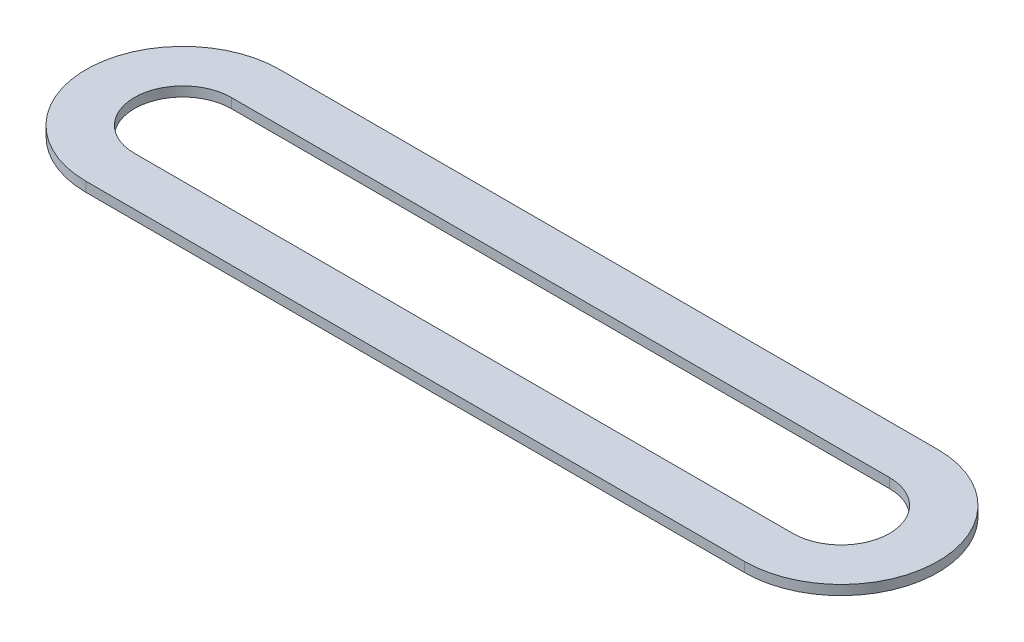
ISO-10303-21;
HEADER;
FILE_DESCRIPTION(('STEP AP214'),'2;1');
FILE_NAME('part.step','',(''),(''),'','','');
FILE_SCHEMA(('AUTOMOTIVE_DESIGN { 1 0 10303 214 1 1 1 1 }'));
ENDSEC;
DATA;
#1=APPLICATION_CONTEXT('core data for automotive mechanical design processes');
#2=APPLICATION_PROTOCOL_DEFINITION('international standard','automotive_design',2000,#1);
#3=PRODUCT_CONTEXT('',#1,'mechanical');
#4=PRODUCT('Part','Part','',(#3));
#5=PRODUCT_RELATED_PRODUCT_CATEGORY('part','',(#4));
#6=PRODUCT_DEFINITION_FORMATION('','',#4);
#7=PRODUCT_DEFINITION_CONTEXT('part definition',#1,'design');
#8=PRODUCT_DEFINITION('design','',#6,#7);
#9=PRODUCT_DEFINITION_SHAPE('','',#8);
#10=(LENGTH_UNIT() NAMED_UNIT(*) SI_UNIT(.MILLI.,.METRE.));
#11=(NAMED_UNIT(*) PLANE_ANGLE_UNIT() SI_UNIT($,.RADIAN.));
#12=(NAMED_UNIT(*) SI_UNIT($,.STERADIAN.) SOLID_ANGLE_UNIT());
#13=UNCERTAINTY_MEASURE_WITH_UNIT(LENGTH_MEASURE(1.E-05),#10,'distance_accuracy_value','');
#14=(GEOMETRIC_REPRESENTATION_CONTEXT(3) GLOBAL_UNCERTAINTY_ASSIGNED_CONTEXT((#13)) GLOBAL_UNIT_ASSIGNED_CONTEXT((#10,
#11,#12)) REPRESENTATION_CONTEXT('',''));
#15=CARTESIAN_POINT('',(0.,0.,0.));
#16=DIRECTION('',(0.,0.,1.));
#17=DIRECTION('',(1.,0.,0.));
#18=AXIS2_PLACEMENT_3D('',#15,#16,#17);
#19=CARTESIAN_POINT('',(0.,0.5,0.));
#20=DIRECTION('',(0.,-1.,0.));
#21=DIRECTION('',(0.,0.,-1.));
#22=AXIS2_PLACEMENT_3D('',#19,#20,#21);
#23=CYLINDRICAL_SURFACE('',#22,2.5);
#24=CARTESIAN_POINT('',(0.,0.,0.));
#25=DIRECTION('',(0.,1.,0.));
#26=DIRECTION('',(0.,0.,1.));
#27=AXIS2_PLACEMENT_3D('',#24,#25,#26);
#28=CIRCLE('',#27,2.5);
#29=CARTESIAN_POINT('',(0.,0.,2.5));
#30=VERTEX_POINT('',#29);
#31=CARTESIAN_POINT('',(0.,0.,-2.5));
#32=VERTEX_POINT('',#31);
#33=EDGE_CURVE('E161',#30,#32,#28,.T.);
#34=ORIENTED_EDGE('',*,*,#33,.F.);
#35=DIRECTION('',(0.,-1.,0.));
#36=VECTOR('',#35,1.);
#37=CARTESIAN_POINT('',(0.,0.5,2.5));
#38=LINE('',#37,#36);
#39=CARTESIAN_POINT('',(0.,0.5,2.5));
#40=VERTEX_POINT('',#39);
#41=EDGE_CURVE('E11',#40,#30,#38,.T.);
#42=ORIENTED_EDGE('',*,*,#41,.F.);
#43=CARTESIAN_POINT('',(0.,0.5,0.));
#44=DIRECTION('',(0.,1.,0.));
#45=DIRECTION('',(0.,0.,1.));
#46=AXIS2_PLACEMENT_3D('',#43,#44,#45);
#47=CIRCLE('',#46,2.5);
#48=CARTESIAN_POINT('',(0.,0.5,-2.5));
#49=VERTEX_POINT('',#48);
#50=EDGE_CURVE('E125',#40,#49,#47,.T.);
#51=ORIENTED_EDGE('',*,*,#50,.T.);
#52=DIRECTION('',(0.,-1.,0.));
#53=VECTOR('',#52,1.);
#54=CARTESIAN_POINT('',(0.,0.5,-2.5));
#55=LINE('',#54,#53);
#56=EDGE_CURVE('E98',#49,#32,#55,.T.);
#57=ORIENTED_EDGE('',*,*,#56,.T.);
#58=EDGE_LOOP('',(#34,#42,#51,#57));
#59=FACE_BOUND('',#58,.T.);
#60=ADVANCED_FACE('F44',(#59),#23,.F.);
#61=CARTESIAN_POINT('',(0.,0.5,2.5));
#62=DIRECTION('',(0.,0.,1.));
#63=DIRECTION('',(1.,0.,0.));
#64=AXIS2_PLACEMENT_3D('',#61,#62,#63);
#65=PLANE('',#64);
#66=DIRECTION('',(-1.,0.,0.));
#67=VECTOR('',#66,1.);
#68=CARTESIAN_POINT('',(0.,0.,2.5));
#69=LINE('',#68,#67);
#70=CARTESIAN_POINT('',(-34.,0.,2.5));
#71=VERTEX_POINT('',#70);
#72=EDGE_CURVE('E132',#30,#71,#69,.T.);
#73=ORIENTED_EDGE('',*,*,#72,.T.);
#74=DIRECTION('',(0.,-1.,0.));
#75=VECTOR('',#74,1.);
#76=CARTESIAN_POINT('',(-34.,0.5,2.5));
#77=LINE('',#76,#75);
#78=CARTESIAN_POINT('',(-34.,0.5,2.5));
#79=VERTEX_POINT('',#78);
#80=EDGE_CURVE('E55',#79,#71,#77,.T.);
#81=ORIENTED_EDGE('',*,*,#80,.F.);
#82=DIRECTION('',(-1.,0.,0.));
#83=VECTOR('',#82,1.);
#84=CARTESIAN_POINT('',(0.,0.5,2.5));
#85=LINE('',#84,#83);
#86=EDGE_CURVE('E120',#40,#79,#85,.T.);
#87=ORIENTED_EDGE('',*,*,#86,.F.);
#88=ORIENTED_EDGE('',*,*,#41,.T.);
#89=EDGE_LOOP('',(#73,#81,#87,#88));
#90=FACE_BOUND('',#89,.T.);
#91=ADVANCED_FACE('F130',(#90),#65,.F.);
#92=CARTESIAN_POINT('',(-34.,0.5,0.));
#93=DIRECTION('',(0.,-1.,0.));
#94=DIRECTION('',(0.,0.,-1.));
#95=AXIS2_PLACEMENT_3D('',#92,#93,#94);
#96=CYLINDRICAL_SURFACE('',#95,2.5);
#97=CARTESIAN_POINT('',(-34.,0.,0.));
#98=DIRECTION('',(0.,1.,0.));
#99=DIRECTION('',(0.,0.,1.));
#100=AXIS2_PLACEMENT_3D('',#97,#98,#99);
#101=CIRCLE('',#100,2.5);
#102=CARTESIAN_POINT('',(-34.,0.,-2.5));
#103=VERTEX_POINT('',#102);
#104=EDGE_CURVE('E167',#103,#71,#101,.T.);
#105=ORIENTED_EDGE('',*,*,#104,.F.);
#106=DIRECTION('',(0.,-1.,0.));
#107=VECTOR('',#106,1.);
#108=CARTESIAN_POINT('',(-34.,0.5,-2.5));
#109=LINE('',#108,#107);
#110=CARTESIAN_POINT('',(-34.,0.5,-2.5));
#111=VERTEX_POINT('',#110);
#112=EDGE_CURVE('E91',#111,#103,#109,.T.);
#113=ORIENTED_EDGE('',*,*,#112,.F.);
#114=CARTESIAN_POINT('',(-34.,0.5,0.));
#115=DIRECTION('',(0.,1.,0.));
#116=DIRECTION('',(0.,0.,1.));
#117=AXIS2_PLACEMENT_3D('',#114,#115,#116);
#118=CIRCLE('',#117,2.5);
#119=EDGE_CURVE('E124',#111,#79,#118,.T.);
#120=ORIENTED_EDGE('',*,*,#119,.T.);
#121=ORIENTED_EDGE('',*,*,#80,.T.);
#122=EDGE_LOOP('',(#105,#113,#120,#121));
#123=FACE_BOUND('',#122,.T.);
#124=ADVANCED_FACE('F138',(#123),#96,.F.);
#125=CARTESIAN_POINT('',(0.,0.5,5.));
#126=DIRECTION('',(0.,0.,-1.));
#127=DIRECTION('',(-1.,0.,0.));
#128=AXIS2_PLACEMENT_3D('',#125,#126,#127);
#129=PLANE('',#128);
#130=DIRECTION('',(1.,0.,0.));
#131=VECTOR('',#130,1.);
#132=CARTESIAN_POINT('',(0.,0.,5.));
#133=LINE('',#132,#131);
#134=CARTESIAN_POINT('',(-34.,0.,5.));
#135=VERTEX_POINT('',#134);
#136=CARTESIAN_POINT('',(0.,0.,5.));
#137=VERTEX_POINT('',#136);
#138=EDGE_CURVE('E146',#135,#137,#133,.T.);
#139=ORIENTED_EDGE('',*,*,#138,.T.);
#140=DIRECTION('',(0.,-1.,0.));
#141=VECTOR('',#140,1.);
#142=CARTESIAN_POINT('',(0.,0.5,5.));
#143=LINE('',#142,#141);
#144=CARTESIAN_POINT('',(0.,0.5,5.));
#145=VERTEX_POINT('',#144);
#146=EDGE_CURVE('E48',#145,#137,#143,.T.);
#147=ORIENTED_EDGE('',*,*,#146,.F.);
#148=DIRECTION('',(1.,0.,0.));
#149=VECTOR('',#148,1.);
#150=CARTESIAN_POINT('',(0.,0.5,5.));
#151=LINE('',#150,#149);
#152=CARTESIAN_POINT('',(-34.,0.5,5.));
#153=VERTEX_POINT('',#152);
#154=EDGE_CURVE('E173',#153,#145,#151,.T.);
#155=ORIENTED_EDGE('',*,*,#154,.F.);
#156=DIRECTION('',(0.,-1.,0.));
#157=VECTOR('',#156,1.);
#158=CARTESIAN_POINT('',(-34.,0.5,5.));
#159=LINE('',#158,#157);
#160=EDGE_CURVE('E142',#153,#135,#159,.T.);
#161=ORIENTED_EDGE('',*,*,#160,.T.);
#162=EDGE_LOOP('',(#139,#147,#155,#161));
#163=FACE_BOUND('',#162,.T.);
#164=ADVANCED_FACE('F46',(#163),#129,.F.);
#165=CARTESIAN_POINT('',(0.,0.5,0.));
#166=DIRECTION('',(0.,-1.,0.));
#167=DIRECTION('',(0.,0.,-1.));
#168=AXIS2_PLACEMENT_3D('',#165,#166,#167);
#169=CYLINDRICAL_SURFACE('',#168,5.);
#170=CARTESIAN_POINT('',(0.,0.,0.));
#171=DIRECTION('',(0.,1.,0.));
#172=DIRECTION('',(0.,0.,1.));
#173=AXIS2_PLACEMENT_3D('',#170,#171,#172);
#174=CIRCLE('',#173,5.);
#175=CARTESIAN_POINT('',(0.,0.,-5.));
#176=VERTEX_POINT('',#175);
#177=EDGE_CURVE('E150',#137,#176,#174,.T.);
#178=ORIENTED_EDGE('',*,*,#177,.T.);
#179=DIRECTION('',(0.,-1.,0.));
#180=VECTOR('',#179,1.);
#181=CARTESIAN_POINT('',(0.,0.5,-5.));
#182=LINE('',#181,#180);
#183=CARTESIAN_POINT('',(0.,0.5,-5.));
#184=VERTEX_POINT('',#183);
#185=EDGE_CURVE('E183',#184,#176,#182,.T.);
#186=ORIENTED_EDGE('',*,*,#185,.F.);
#187=CARTESIAN_POINT('',(0.,0.5,0.));
#188=DIRECTION('',(0.,1.,0.));
#189=DIRECTION('',(0.,0.,1.));
#190=AXIS2_PLACEMENT_3D('',#187,#188,#189);
#191=CIRCLE('',#190,5.);
#192=EDGE_CURVE('E106',#145,#184,#191,.T.);
#193=ORIENTED_EDGE('',*,*,#192,.F.);
#194=ORIENTED_EDGE('',*,*,#146,.T.);
#195=EDGE_LOOP('',(#178,#186,#193,#194));
#196=FACE_BOUND('',#195,.T.);
#197=ADVANCED_FACE('F190',(#196),#169,.T.);
#198=CARTESIAN_POINT('',(0.,0.5,-5.));
#199=DIRECTION('',(0.,0.,-1.));
#200=DIRECTION('',(-1.,0.,0.));
#201=AXIS2_PLACEMENT_3D('',#198,#199,#200);
#202=PLANE('',#201);
#203=DIRECTION('',(1.,0.,0.));
#204=VECTOR('',#203,1.);
#205=CARTESIAN_POINT('',(0.,0.,-5.));
#206=LINE('',#205,#204);
#207=CARTESIAN_POINT('',(-34.,0.,-5.));
#208=VERTEX_POINT('',#207);
#209=EDGE_CURVE('E154',#208,#176,#206,.T.);
#210=ORIENTED_EDGE('',*,*,#209,.F.);
#211=DIRECTION('',(0.,-1.,0.));
#212=VECTOR('',#211,1.);
#213=CARTESIAN_POINT('',(-34.,0.5,-5.));
#214=LINE('',#213,#212);
#215=CARTESIAN_POINT('',(-34.,0.5,-5.));
#216=VERTEX_POINT('',#215);
#217=EDGE_CURVE('E181',#216,#208,#214,.T.);
#218=ORIENTED_EDGE('',*,*,#217,.F.);
#219=DIRECTION('',(1.,0.,0.));
#220=VECTOR('',#219,1.);
#221=CARTESIAN_POINT('',(0.,0.5,-5.));
#222=LINE('',#221,#220);
#223=EDGE_CURVE('E202',#216,#184,#222,.T.);
#224=ORIENTED_EDGE('',*,*,#223,.T.);
#225=ORIENTED_EDGE('',*,*,#185,.T.);
#226=EDGE_LOOP('',(#210,#218,#224,#225));
#227=FACE_BOUND('',#226,.T.);
#228=ADVANCED_FACE('F199',(#227),#202,.T.);
#229=CARTESIAN_POINT('',(-34.,0.5,0.));
#230=DIRECTION('',(0.,-1.,0.));
#231=DIRECTION('',(0.,0.,-1.));
#232=AXIS2_PLACEMENT_3D('',#229,#230,#231);
#233=CYLINDRICAL_SURFACE('',#232,5.);
#234=CARTESIAN_POINT('',(-34.,0.,0.));
#235=DIRECTION('',(0.,1.,0.));
#236=DIRECTION('',(0.,0.,1.));
#237=AXIS2_PLACEMENT_3D('',#234,#235,#236);
#238=CIRCLE('',#237,5.);
#239=EDGE_CURVE('E158',#208,#135,#238,.T.);
#240=ORIENTED_EDGE('',*,*,#239,.T.);
#241=ORIENTED_EDGE('',*,*,#160,.F.);
#242=CARTESIAN_POINT('',(-34.,0.5,0.));
#243=DIRECTION('',(0.,1.,0.));
#244=DIRECTION('',(0.,0.,1.));
#245=AXIS2_PLACEMENT_3D('',#242,#243,#244);
#246=CIRCLE('',#245,5.);
#247=EDGE_CURVE('E204',#216,#153,#246,.T.);
#248=ORIENTED_EDGE('',*,*,#247,.F.);
#249=ORIENTED_EDGE('',*,*,#217,.T.);
#250=EDGE_LOOP('',(#240,#241,#248,#249));
#251=FACE_BOUND('',#250,.T.);
#252=ADVANCED_FACE('F205',(#251),#233,.T.);
#253=CARTESIAN_POINT('',(0.,0.5,-2.5));
#254=DIRECTION('',(0.,0.,-1.));
#255=DIRECTION('',(-1.,0.,0.));
#256=AXIS2_PLACEMENT_3D('',#253,#254,#255);
#257=PLANE('',#256);
#258=DIRECTION('',(1.,0.,0.));
#259=VECTOR('',#258,1.);
#260=CARTESIAN_POINT('',(0.,0.,-2.5));
#261=LINE('',#260,#259);
#262=EDGE_CURVE('E170',#103,#32,#261,.T.);
#263=ORIENTED_EDGE('',*,*,#262,.T.);
#264=ORIENTED_EDGE('',*,*,#56,.F.);
#265=DIRECTION('',(1.,0.,0.));
#266=VECTOR('',#265,1.);
#267=CARTESIAN_POINT('',(0.,0.5,-2.5));
#268=LINE('',#267,#266);
#269=EDGE_CURVE('E64',#111,#49,#268,.T.);
#270=ORIENTED_EDGE('',*,*,#269,.F.);
#271=ORIENTED_EDGE('',*,*,#112,.T.);
#272=EDGE_LOOP('',(#263,#264,#270,#271));
#273=FACE_BOUND('',#272,.T.);
#274=ADVANCED_FACE('F215',(#273),#257,.F.);
#275=CARTESIAN_POINT('',(0.,0.5,0.));
#276=DIRECTION('',(0.,1.,0.));
#277=DIRECTION('',(0.,0.,1.));
#278=AXIS2_PLACEMENT_3D('',#275,#276,#277);
#279=PLANE('',#278);
#280=ORIENTED_EDGE('',*,*,#154,.T.);
#281=ORIENTED_EDGE('',*,*,#192,.T.);
#282=ORIENTED_EDGE('',*,*,#223,.F.);
#283=ORIENTED_EDGE('',*,*,#247,.T.);
#284=EDGE_LOOP('',(#280,#281,#282,#283));
#285=FACE_BOUND('',#284,.T.);
#286=ORIENTED_EDGE('',*,*,#50,.F.);
#287=ORIENTED_EDGE('',*,*,#86,.T.);
#288=ORIENTED_EDGE('',*,*,#119,.F.);
#289=ORIENTED_EDGE('',*,*,#269,.T.);
#290=EDGE_LOOP('',(#286,#287,#288,#289));
#291=FACE_BOUND('',#290,.T.);
#292=ADVANCED_FACE('F122',(#285,#291),#279,.T.);
#293=CARTESIAN_POINT('',(0.,0.,0.));
#294=DIRECTION('',(0.,1.,0.));
#295=DIRECTION('',(0.,0.,1.));
#296=AXIS2_PLACEMENT_3D('',#293,#294,#295);
#297=PLANE('',#296);
#298=ORIENTED_EDGE('',*,*,#138,.F.);
#299=ORIENTED_EDGE('',*,*,#239,.F.);
#300=ORIENTED_EDGE('',*,*,#209,.T.);
#301=ORIENTED_EDGE('',*,*,#177,.F.);
#302=EDGE_LOOP('',(#298,#299,#300,#301));
#303=FACE_BOUND('',#302,.T.);
#304=ORIENTED_EDGE('',*,*,#33,.T.);
#305=ORIENTED_EDGE('',*,*,#262,.F.);
#306=ORIENTED_EDGE('',*,*,#104,.T.);
#307=ORIENTED_EDGE('',*,*,#72,.F.);
#308=EDGE_LOOP('',(#304,#305,#306,#307));
#309=FACE_BOUND('',#308,.T.);
#310=ADVANCED_FACE('F197',(#303,#309),#297,.F.);
#311=CLOSED_SHELL('',(#60,#91,#124,#164,#197,#228,#252,#274,#292,#310));
#312=MANIFOLD_SOLID_BREP('B2',#311);
#313=ADVANCED_BREP_SHAPE_REPRESENTATION('',(#18,#312),#14);
#314=SHAPE_DEFINITION_REPRESENTATION(#9,#313);
ENDSEC;
END-ISO-10303-21;
